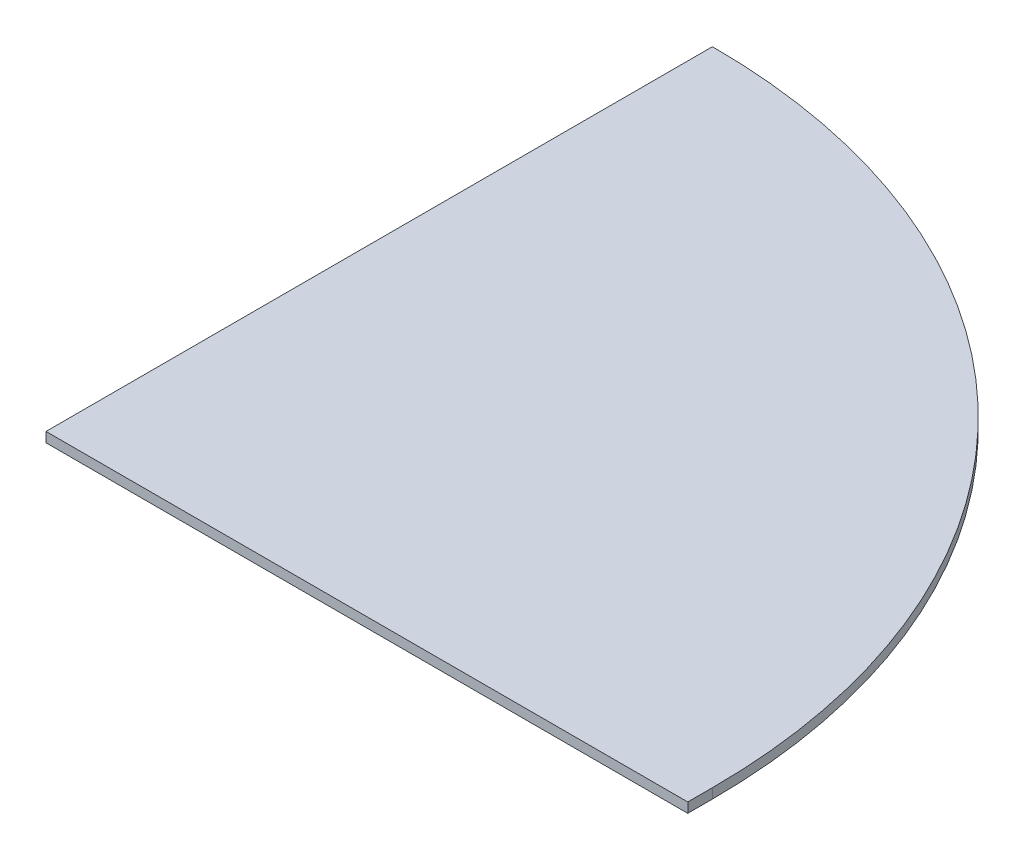
ISO-10303-21;
HEADER;
FILE_DESCRIPTION(('STEP AP214'),'2;1');
FILE_NAME('part.step','',(''),(''),'','','');
FILE_SCHEMA(('AUTOMOTIVE_DESIGN { 1 0 10303 214 1 1 1 1 }'));
ENDSEC;
DATA;
#1=APPLICATION_CONTEXT('core data for automotive mechanical design processes');
#2=APPLICATION_PROTOCOL_DEFINITION('international standard','automotive_design',2000,#1);
#3=PRODUCT_CONTEXT('',#1,'mechanical');
#4=PRODUCT('Part','Part','',(#3));
#5=PRODUCT_RELATED_PRODUCT_CATEGORY('part','',(#4));
#6=PRODUCT_DEFINITION_FORMATION('','',#4);
#7=PRODUCT_DEFINITION_CONTEXT('part definition',#1,'design');
#8=PRODUCT_DEFINITION('design','',#6,#7);
#9=PRODUCT_DEFINITION_SHAPE('','',#8);
#10=(LENGTH_UNIT() NAMED_UNIT(*) SI_UNIT(.MILLI.,.METRE.));
#11=(NAMED_UNIT(*) PLANE_ANGLE_UNIT() SI_UNIT($,.RADIAN.));
#12=(NAMED_UNIT(*) SI_UNIT($,.STERADIAN.) SOLID_ANGLE_UNIT());
#13=UNCERTAINTY_MEASURE_WITH_UNIT(LENGTH_MEASURE(1.E-05),#10,'distance_accuracy_value','');
#14=(GEOMETRIC_REPRESENTATION_CONTEXT(3) GLOBAL_UNCERTAINTY_ASSIGNED_CONTEXT((#13)) GLOBAL_UNIT_ASSIGNED_CONTEXT((#10,
#11,#12)) REPRESENTATION_CONTEXT('',''));
#15=CARTESIAN_POINT('',(0.,0.,0.));
#16=DIRECTION('',(0.,0.,1.));
#17=DIRECTION('',(1.,0.,0.));
#18=AXIS2_PLACEMENT_3D('',#15,#16,#17);
#19=CARTESIAN_POINT('',(0.,10.16,0.));
#20=DIRECTION('',(1.,0.,0.));
#21=DIRECTION('',(0.,0.,-1.));
#22=AXIS2_PLACEMENT_3D('',#19,#20,#21);
#23=PLANE('',#22);
#24=DIRECTION('',(0.,0.,1.));
#25=VECTOR('',#24,1.);
#26=CARTESIAN_POINT('',(0.,0.,0.));
#27=LINE('',#26,#25);
#28=CARTESIAN_POINT('',(0.,0.,-660.4));
#29=VERTEX_POINT('',#28);
#30=CARTESIAN_POINT('',(0.,0.,25.4000000000002));
#31=VERTEX_POINT('',#30);
#32=EDGE_CURVE('E132',#29,#31,#27,.T.);
#33=ORIENTED_EDGE('',*,*,#32,.T.);
#34=DIRECTION('',(0.,-1.,0.));
#35=VECTOR('',#34,1.);
#36=CARTESIAN_POINT('',(0.,10.16,25.4000000000002));
#37=LINE('',#36,#35);
#38=CARTESIAN_POINT('',(0.,10.16,25.4000000000002));
#39=VERTEX_POINT('',#38);
#40=EDGE_CURVE('E12',#39,#31,#37,.T.);
#41=ORIENTED_EDGE('',*,*,#40,.F.);
#42=DIRECTION('',(0.,0.,1.));
#43=VECTOR('',#42,1.);
#44=CARTESIAN_POINT('',(0.,10.16,0.));
#45=LINE('',#44,#43);
#46=CARTESIAN_POINT('',(0.,10.16,-660.4));
#47=VERTEX_POINT('',#46);
#48=EDGE_CURVE('E86',#47,#39,#45,.T.);
#49=ORIENTED_EDGE('',*,*,#48,.F.);
#50=DIRECTION('',(0.,-1.,0.));
#51=VECTOR('',#50,1.);
#52=CARTESIAN_POINT('',(0.,10.16,-660.4));
#53=LINE('',#52,#51);
#54=EDGE_CURVE('E109',#47,#29,#53,.T.);
#55=ORIENTED_EDGE('',*,*,#54,.T.);
#56=EDGE_LOOP('',(#33,#41,#49,#55));
#57=FACE_BOUND('',#56,.T.);
#58=ADVANCED_FACE('F46',(#57),#23,.F.);
#59=CARTESIAN_POINT('',(0.,10.16,25.4000000000002));
#60=DIRECTION('',(0.,0.,1.));
#61=DIRECTION('',(1.,0.,0.));
#62=AXIS2_PLACEMENT_3D('',#59,#60,#61);
#63=PLANE('',#62);
#64=DIRECTION('',(-1.,0.,0.));
#65=VECTOR('',#64,1.);
#66=CARTESIAN_POINT('',(0.,0.,25.4000000000002));
#67=LINE('',#66,#65);
#68=CARTESIAN_POINT('',(660.4,0.,25.4000000000002));
#69=VERTEX_POINT('',#68);
#70=EDGE_CURVE('E95',#69,#31,#67,.T.);
#71=ORIENTED_EDGE('',*,*,#70,.F.);
#72=DIRECTION('',(0.,-1.,0.));
#73=VECTOR('',#72,1.);
#74=CARTESIAN_POINT('',(660.4,10.16,25.4000000000002));
#75=LINE('',#74,#73);
#76=CARTESIAN_POINT('',(660.4,10.16,25.4000000000002));
#77=VERTEX_POINT('',#76);
#78=EDGE_CURVE('E55',#77,#69,#75,.T.);
#79=ORIENTED_EDGE('',*,*,#78,.F.);
#80=DIRECTION('',(-1.,0.,0.));
#81=VECTOR('',#80,1.);
#82=CARTESIAN_POINT('',(0.,10.16,25.4000000000002));
#83=LINE('',#82,#81);
#84=EDGE_CURVE('E93',#77,#39,#83,.T.);
#85=ORIENTED_EDGE('',*,*,#84,.T.);
#86=ORIENTED_EDGE('',*,*,#40,.T.);
#87=EDGE_LOOP('',(#71,#79,#85,#86));
#88=FACE_BOUND('',#87,.T.);
#89=ADVANCED_FACE('F92',(#88),#63,.T.);
#90=CARTESIAN_POINT('',(660.4,10.16,0.));
#91=DIRECTION('',(1.,0.,0.));
#92=DIRECTION('',(0.,0.,-1.));
#93=AXIS2_PLACEMENT_3D('',#90,#91,#92);
#94=PLANE('',#93);
#95=DIRECTION('',(0.,0.,1.));
#96=VECTOR('',#95,1.);
#97=CARTESIAN_POINT('',(660.4,0.,0.));
#98=LINE('',#97,#96);
#99=CARTESIAN_POINT('',(660.4,0.,0.));
#100=VERTEX_POINT('',#99);
#101=EDGE_CURVE('E120',#100,#69,#98,.T.);
#102=ORIENTED_EDGE('',*,*,#101,.F.);
#103=DIRECTION('',(0.,-1.,0.));
#104=VECTOR('',#103,1.);
#105=CARTESIAN_POINT('',(660.4,10.16,0.));
#106=LINE('',#105,#104);
#107=CARTESIAN_POINT('',(660.4,10.16,0.));
#108=VERTEX_POINT('',#107);
#109=EDGE_CURVE('E78',#108,#100,#106,.T.);
#110=ORIENTED_EDGE('',*,*,#109,.F.);
#111=DIRECTION('',(0.,0.,1.));
#112=VECTOR('',#111,1.);
#113=CARTESIAN_POINT('',(660.4,10.16,0.));
#114=LINE('',#113,#112);
#115=EDGE_CURVE('E102',#108,#77,#114,.T.);
#116=ORIENTED_EDGE('',*,*,#115,.T.);
#117=ORIENTED_EDGE('',*,*,#78,.T.);
#118=EDGE_LOOP('',(#102,#110,#116,#117));
#119=FACE_BOUND('',#118,.T.);
#120=ADVANCED_FACE('F105',(#119),#94,.T.);
#121=CARTESIAN_POINT('',(0.,10.16,0.));
#122=DIRECTION('',(0.,-1.,0.));
#123=DIRECTION('',(0.,0.,-1.));
#124=AXIS2_PLACEMENT_3D('',#121,#122,#123);
#125=CYLINDRICAL_SURFACE('',#124,660.4);
#126=CARTESIAN_POINT('',(0.,0.,0.));
#127=DIRECTION('',(0.,1.,0.));
#128=DIRECTION('',(0.,0.,1.));
#129=AXIS2_PLACEMENT_3D('',#126,#127,#128);
#130=CIRCLE('',#129,660.4);
#131=EDGE_CURVE('E81',#100,#29,#130,.T.);
#132=ORIENTED_EDGE('',*,*,#131,.T.);
#133=ORIENTED_EDGE('',*,*,#54,.F.);
#134=CARTESIAN_POINT('',(0.,10.16,0.));
#135=DIRECTION('',(0.,1.,0.));
#136=DIRECTION('',(0.,0.,1.));
#137=AXIS2_PLACEMENT_3D('',#134,#135,#136);
#138=CIRCLE('',#137,660.4);
#139=EDGE_CURVE('E63',#108,#47,#138,.T.);
#140=ORIENTED_EDGE('',*,*,#139,.F.);
#141=ORIENTED_EDGE('',*,*,#109,.T.);
#142=EDGE_LOOP('',(#132,#133,#140,#141));
#143=FACE_BOUND('',#142,.T.);
#144=ADVANCED_FACE('F142',(#143),#125,.T.);
#145=CARTESIAN_POINT('',(0.,10.16,0.));
#146=DIRECTION('',(0.,1.,0.));
#147=DIRECTION('',(0.,0.,1.));
#148=AXIS2_PLACEMENT_3D('',#145,#146,#147);
#149=PLANE('',#148);
#150=ORIENTED_EDGE('',*,*,#48,.T.);
#151=ORIENTED_EDGE('',*,*,#84,.F.);
#152=ORIENTED_EDGE('',*,*,#115,.F.);
#153=ORIENTED_EDGE('',*,*,#139,.T.);
#154=EDGE_LOOP('',(#150,#151,#152,#153));
#155=FACE_BOUND('',#154,.T.);
#156=ADVANCED_FACE('F101',(#155),#149,.T.);
#157=CARTESIAN_POINT('',(0.,0.,0.));
#158=DIRECTION('',(0.,1.,0.));
#159=DIRECTION('',(0.,0.,1.));
#160=AXIS2_PLACEMENT_3D('',#157,#158,#159);
#161=PLANE('',#160);
#162=ORIENTED_EDGE('',*,*,#32,.F.);
#163=ORIENTED_EDGE('',*,*,#131,.F.);
#164=ORIENTED_EDGE('',*,*,#101,.T.);
#165=ORIENTED_EDGE('',*,*,#70,.T.);
#166=EDGE_LOOP('',(#162,#163,#164,#165));
#167=FACE_BOUND('',#166,.T.);
#168=ADVANCED_FACE('F134',(#167),#161,.F.);
#169=CLOSED_SHELL('',(#58,#89,#120,#144,#156,#168));
#170=MANIFOLD_SOLID_BREP('B2',#169);
#171=ADVANCED_BREP_SHAPE_REPRESENTATION('',(#18,#170),#14);
#172=SHAPE_DEFINITION_REPRESENTATION(#9,#171);
ENDSEC;
END-ISO-10303-21;
